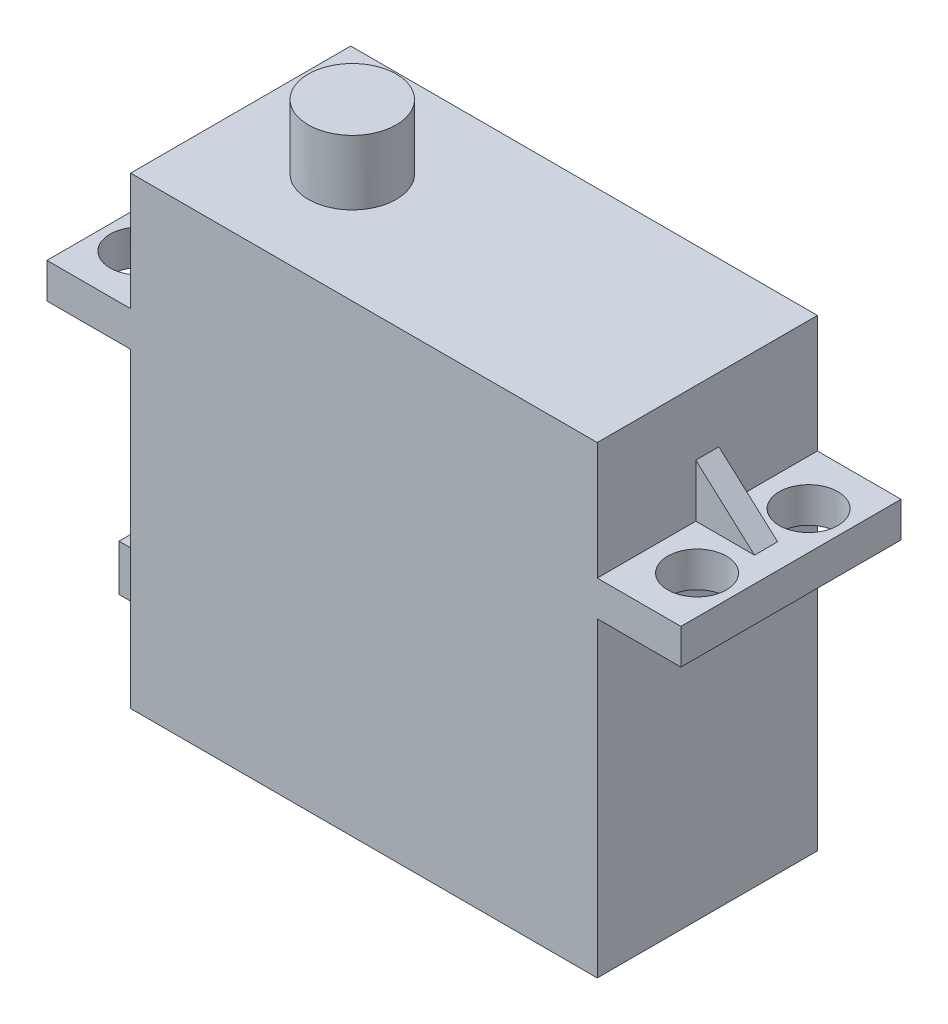
ISO-10303-21;
HEADER;
FILE_DESCRIPTION(('STEP AP214'),'2;1');
FILE_NAME('part.step','',(''),(''),'','','');
FILE_SCHEMA(('AUTOMOTIVE_DESIGN { 1 0 10303 214 1 1 1 1 }'));
ENDSEC;
DATA;
#1=APPLICATION_CONTEXT('core data for automotive mechanical design processes');
#2=APPLICATION_PROTOCOL_DEFINITION('international standard','automotive_design',2000,#1);
#3=PRODUCT_CONTEXT('',#1,'mechanical');
#4=PRODUCT('Part','Part','',(#3));
#5=PRODUCT_RELATED_PRODUCT_CATEGORY('part','',(#4));
#6=PRODUCT_DEFINITION_FORMATION('','',#4);
#7=PRODUCT_DEFINITION_CONTEXT('part definition',#1,'design');
#8=PRODUCT_DEFINITION('design','',#6,#7);
#9=PRODUCT_DEFINITION_SHAPE('','',#8);
#10=(LENGTH_UNIT() NAMED_UNIT(*) SI_UNIT(.MILLI.,.METRE.));
#11=(NAMED_UNIT(*) PLANE_ANGLE_UNIT() SI_UNIT($,.RADIAN.));
#12=(NAMED_UNIT(*) SI_UNIT($,.STERADIAN.) SOLID_ANGLE_UNIT());
#13=UNCERTAINTY_MEASURE_WITH_UNIT(LENGTH_MEASURE(1.E-05),#10,'distance_accuracy_value','');
#14=(GEOMETRIC_REPRESENTATION_CONTEXT(3) GLOBAL_UNCERTAINTY_ASSIGNED_CONTEXT((#13)) GLOBAL_UNIT_ASSIGNED_CONTEXT((#10,
#11,#12)) REPRESENTATION_CONTEXT('',''));
#15=CARTESIAN_POINT('',(0.,0.,0.));
#16=DIRECTION('',(0.,0.,1.));
#17=DIRECTION('',(1.,0.,0.));
#18=AXIS2_PLACEMENT_3D('',#15,#16,#17);
#19=CARTESIAN_POINT('',(40.386,0.,19.05));
#20=DIRECTION('',(-1.,0.,0.));
#21=DIRECTION('',(0.,0.,1.));
#22=AXIS2_PLACEMENT_3D('',#19,#20,#21);
#23=PLANE('',#22);
#24=DIRECTION('',(0.,-1.,0.));
#25=VECTOR('',#24,1.);
#26=CARTESIAN_POINT('',(40.386,34.5510501198393,10.525));
#27=LINE('',#26,#25);
#28=CARTESIAN_POINT('',(40.386,34.5510501198393,10.525));
#29=VERTEX_POINT('',#28);
#30=CARTESIAN_POINT('',(40.386,29.972,10.525));
#31=VERTEX_POINT('',#30);
#32=EDGE_CURVE('E49',#29,#31,#27,.T.);
#33=ORIENTED_EDGE('',*,*,#32,.F.);
#34=DIRECTION('',(0.,0.,-1.));
#35=VECTOR('',#34,1.);
#36=CARTESIAN_POINT('',(40.386,34.5510501198393,10.525));
#37=LINE('',#36,#35);
#38=CARTESIAN_POINT('',(40.386,34.5510501198393,8.52500000000001));
#39=VERTEX_POINT('',#38);
#40=EDGE_CURVE('E54',#29,#39,#37,.T.);
#41=ORIENTED_EDGE('',*,*,#40,.T.);
#42=DIRECTION('',(0.,-1.,0.));
#43=VECTOR('',#42,1.);
#44=CARTESIAN_POINT('',(40.386,34.5510501198393,8.52500000000001));
#45=LINE('',#44,#43);
#46=CARTESIAN_POINT('',(40.386,29.972,8.52500000000001));
#47=VERTEX_POINT('',#46);
#48=EDGE_CURVE('E195',#39,#47,#45,.T.);
#49=ORIENTED_EDGE('',*,*,#48,.T.);
#50=DIRECTION('',(0.,0.,1.));
#51=VECTOR('',#50,1.);
#52=CARTESIAN_POINT('',(40.386,29.972,-7.85451621680165));
#53=LINE('',#52,#51);
#54=CARTESIAN_POINT('',(40.386,29.972,0.));
#55=VERTEX_POINT('',#54);
#56=EDGE_CURVE('E183',#55,#47,#53,.T.);
#57=ORIENTED_EDGE('',*,*,#56,.F.);
#58=DIRECTION('',(0.,1.,0.));
#59=VECTOR('',#58,1.);
#60=CARTESIAN_POINT('',(40.386,0.,0.));
#61=LINE('',#60,#59);
#62=CARTESIAN_POINT('',(40.386,40.132,0.));
#63=VERTEX_POINT('',#62);
#64=EDGE_CURVE('E349',#55,#63,#61,.T.);
#65=ORIENTED_EDGE('',*,*,#64,.T.);
#66=DIRECTION('',(0.,0.,-1.));
#67=VECTOR('',#66,1.);
#68=CARTESIAN_POINT('',(40.386,40.132,19.05));
#69=LINE('',#68,#67);
#70=CARTESIAN_POINT('',(40.386,40.132,19.05));
#71=VERTEX_POINT('',#70);
#72=EDGE_CURVE('E357',#71,#63,#69,.T.);
#73=ORIENTED_EDGE('',*,*,#72,.F.);
#74=DIRECTION('',(0.,1.,0.));
#75=VECTOR('',#74,1.);
#76=CARTESIAN_POINT('',(40.386,0.,19.05));
#77=LINE('',#76,#75);
#78=CARTESIAN_POINT('',(40.386,29.972,19.05));
#79=VERTEX_POINT('',#78);
#80=EDGE_CURVE('E337',#79,#71,#77,.T.);
#81=ORIENTED_EDGE('',*,*,#80,.F.);
#82=EDGE_CURVE('E192',#31,#79,#53,.T.);
#83=ORIENTED_EDGE('',*,*,#82,.F.);
#84=EDGE_LOOP('',(#33,#41,#49,#57,#65,#73,#81,#83));
#85=FACE_BOUND('',#84,.T.);
#86=ADVANCED_FACE('F34',(#85),#23,.F.);
#87=CARTESIAN_POINT('',(40.386,29.972,-7.85451621680165));
#88=DIRECTION('',(0.,1.,0.));
#89=DIRECTION('',(0.,0.,1.));
#90=AXIS2_PLACEMENT_3D('',#87,#88,#89);
#91=PLANE('',#90);
#92=CARTESIAN_POINT('',(44.323,29.972,14.351));
#93=DIRECTION('',(0.,1.,0.));
#94=DIRECTION('',(0.,0.,1.));
#95=AXIS2_PLACEMENT_3D('',#92,#93,#94);
#96=CIRCLE('',#95,2.54);
#97=CARTESIAN_POINT('',(44.323,29.972,16.891));
#98=VERTEX_POINT('',#97);
#99=EDGE_CURVE('E269',#98,#98,#96,.T.);
#100=ORIENTED_EDGE('',*,*,#99,.F.);
#101=EDGE_LOOP('',(#100));
#102=FACE_BOUND('',#101,.T.);
#103=CARTESIAN_POINT('',(44.323,29.972,4.699));
#104=DIRECTION('',(0.,1.,0.));
#105=DIRECTION('',(0.,0.,1.));
#106=AXIS2_PLACEMENT_3D('',#103,#104,#105);
#107=CIRCLE('',#106,2.54);
#108=CARTESIAN_POINT('',(44.323,29.972,7.239));
#109=VERTEX_POINT('',#108);
#110=EDGE_CURVE('E265',#109,#109,#107,.T.);
#111=ORIENTED_EDGE('',*,*,#110,.F.);
#112=EDGE_LOOP('',(#111));
#113=FACE_BOUND('',#112,.T.);
#114=DIRECTION('',(0.,0.,-1.));
#115=VECTOR('',#114,1.);
#116=CARTESIAN_POINT('',(45.466,29.972,10.525));
#117=LINE('',#116,#115);
#118=CARTESIAN_POINT('',(45.466,29.972,10.525));
#119=VERTEX_POINT('',#118);
#120=CARTESIAN_POINT('',(45.466,29.972,8.52500000000001));
#121=VERTEX_POINT('',#120);
#122=EDGE_CURVE('E208',#119,#121,#117,.T.);
#123=ORIENTED_EDGE('',*,*,#122,.F.);
#124=DIRECTION('',(1.,0.,0.));
#125=VECTOR('',#124,1.);
#126=CARTESIAN_POINT('',(40.386,29.972,10.525));
#127=LINE('',#126,#125);
#128=EDGE_CURVE('E197',#31,#119,#127,.T.);
#129=ORIENTED_EDGE('',*,*,#128,.F.);
#130=ORIENTED_EDGE('',*,*,#82,.T.);
#131=DIRECTION('',(-1.,0.,0.));
#132=VECTOR('',#131,1.);
#133=CARTESIAN_POINT('',(40.386,29.972,19.05));
#134=LINE('',#133,#132);
#135=CARTESIAN_POINT('',(47.625,29.972,19.05));
#136=VERTEX_POINT('',#135);
#137=EDGE_CURVE('E282',#136,#79,#134,.T.);
#138=ORIENTED_EDGE('',*,*,#137,.F.);
#139=DIRECTION('',(0.,0.,1.));
#140=VECTOR('',#139,1.);
#141=CARTESIAN_POINT('',(47.625,29.972,-7.85451621680165));
#142=LINE('',#141,#140);
#143=CARTESIAN_POINT('',(47.625,29.972,0.));
#144=VERTEX_POINT('',#143);
#145=EDGE_CURVE('E295',#144,#136,#142,.T.);
#146=ORIENTED_EDGE('',*,*,#145,.F.);
#147=DIRECTION('',(-1.,0.,0.));
#148=VECTOR('',#147,1.);
#149=CARTESIAN_POINT('',(40.386,29.972,0.));
#150=LINE('',#149,#148);
#151=EDGE_CURVE('E189',#144,#55,#150,.T.);
#152=ORIENTED_EDGE('',*,*,#151,.T.);
#153=ORIENTED_EDGE('',*,*,#56,.T.);
#154=DIRECTION('',(1.,0.,0.));
#155=VECTOR('',#154,1.);
#156=CARTESIAN_POINT('',(40.386,29.972,8.52500000000001));
#157=LINE('',#156,#155);
#158=EDGE_CURVE('E186',#47,#121,#157,.T.);
#159=ORIENTED_EDGE('',*,*,#158,.T.);
#160=EDGE_LOOP('',(#123,#129,#130,#138,#146,#152,#153,#159));
#161=FACE_BOUND('',#160,.T.);
#162=ADVANCED_FACE('F184',(#102,#113,#161),#91,.T.);
#163=CARTESIAN_POINT('',(0.,0.,19.05));
#164=DIRECTION('',(1.,0.,0.));
#165=DIRECTION('',(0.,0.,-1.));
#166=AXIS2_PLACEMENT_3D('',#163,#164,#165);
#167=PLANE('',#166);
#168=DIRECTION('',(0.,0.,1.));
#169=VECTOR('',#168,1.);
#170=CARTESIAN_POINT('',(0.,26.924,-7.85451621680165));
#171=LINE('',#170,#169);
#172=CARTESIAN_POINT('',(0.,26.924,0.));
#173=VERTEX_POINT('',#172);
#174=CARTESIAN_POINT('',(0.,26.924,19.05));
#175=VERTEX_POINT('',#174);
#176=EDGE_CURVE('E318',#173,#175,#171,.T.);
#177=ORIENTED_EDGE('',*,*,#176,.F.);
#178=DIRECTION('',(0.,-1.,0.));
#179=VECTOR('',#178,1.);
#180=CARTESIAN_POINT('',(0.,0.,0.));
#181=LINE('',#180,#179);
#182=CARTESIAN_POINT('',(0.,0.,0.));
#183=VERTEX_POINT('',#182);
#184=EDGE_CURVE('E330',#173,#183,#181,.T.);
#185=ORIENTED_EDGE('',*,*,#184,.T.);
#186=DIRECTION('',(0.,0.,-1.));
#187=VECTOR('',#186,1.);
#188=CARTESIAN_POINT('',(0.,0.,19.05));
#189=LINE('',#188,#187);
#190=CARTESIAN_POINT('',(0.,0.,19.05));
#191=VERTEX_POINT('',#190);
#192=EDGE_CURVE('E42',#191,#183,#189,.T.);
#193=ORIENTED_EDGE('',*,*,#192,.F.);
#194=DIRECTION('',(0.,-1.,0.));
#195=VECTOR('',#194,1.);
#196=CARTESIAN_POINT('',(0.,0.,19.05));
#197=LINE('',#196,#195);
#198=EDGE_CURVE('E335',#175,#191,#197,.T.);
#199=ORIENTED_EDGE('',*,*,#198,.F.);
#200=EDGE_LOOP('',(#177,#185,#193,#199));
#201=FACE_BOUND('',#200,.T.);
#202=DIRECTION('',(0.,-1.,0.));
#203=VECTOR('',#202,1.);
#204=CARTESIAN_POINT('',(0.,7.048,5.));
#205=LINE('',#204,#203);
#206=CARTESIAN_POINT('',(0.,7.048,5.));
#207=VERTEX_POINT('',#206);
#208=CARTESIAN_POINT('',(0.,3.048,5.));
#209=VERTEX_POINT('',#208);
#210=EDGE_CURVE('E229',#207,#209,#205,.T.);
#211=ORIENTED_EDGE('',*,*,#210,.F.);
#212=DIRECTION('',(0.,0.,-1.));
#213=VECTOR('',#212,1.);
#214=CARTESIAN_POINT('',(0.,7.048,5.));
#215=LINE('',#214,#213);
#216=CARTESIAN_POINT('',(0.,7.048,14.05));
#217=VERTEX_POINT('',#216);
#218=EDGE_CURVE('E234',#217,#207,#215,.T.);
#219=ORIENTED_EDGE('',*,*,#218,.F.);
#220=DIRECTION('',(0.,1.,0.));
#221=VECTOR('',#220,1.);
#222=CARTESIAN_POINT('',(0.,7.048,14.05));
#223=LINE('',#222,#221);
#224=CARTESIAN_POINT('',(0.,3.048,14.05));
#225=VERTEX_POINT('',#224);
#226=EDGE_CURVE('E246',#225,#217,#223,.T.);
#227=ORIENTED_EDGE('',*,*,#226,.F.);
#228=DIRECTION('',(0.,0.,1.));
#229=VECTOR('',#228,1.);
#230=CARTESIAN_POINT('',(0.,3.048,5.));
#231=LINE('',#230,#229);
#232=EDGE_CURVE('E243',#209,#225,#231,.T.);
#233=ORIENTED_EDGE('',*,*,#232,.F.);
#234=EDGE_LOOP('',(#211,#219,#227,#233));
#235=FACE_BOUND('',#234,.T.);
#236=ADVANCED_FACE('F398',(#201,#235),#167,.F.);
#237=DIRECTION('',(0.,0.,-1.));
#238=VECTOR('',#237,1.);
#239=CARTESIAN_POINT('',(0.,32.512,10.525));
#240=LINE('',#239,#238);
#241=CARTESIAN_POINT('',(0.,32.512,10.525));
#242=VERTEX_POINT('',#241);
#243=CARTESIAN_POINT('',(0.,32.512,8.52500000000001));
#244=VERTEX_POINT('',#243);
#245=EDGE_CURVE('E227',#242,#244,#240,.T.);
#246=ORIENTED_EDGE('',*,*,#245,.F.);
#247=DIRECTION('',(0.,1.,0.));
#248=VECTOR('',#247,1.);
#249=CARTESIAN_POINT('',(0.,32.512,10.525));
#250=LINE('',#249,#248);
#251=CARTESIAN_POINT('',(0.,29.972,10.525));
#252=VERTEX_POINT('',#251);
#253=EDGE_CURVE('E213',#252,#242,#250,.T.);
#254=ORIENTED_EDGE('',*,*,#253,.F.);
#255=DIRECTION('',(0.,0.,1.));
#256=VECTOR('',#255,1.);
#257=CARTESIAN_POINT('',(0.,29.972,-7.85451621680165));
#258=LINE('',#257,#256);
#259=CARTESIAN_POINT('',(0.,29.972,19.05));
#260=VERTEX_POINT('',#259);
#261=EDGE_CURVE('E324',#252,#260,#258,.T.);
#262=ORIENTED_EDGE('',*,*,#261,.T.);
#263=CARTESIAN_POINT('',(0.,40.132,19.05));
#264=VERTEX_POINT('',#263);
#265=EDGE_CURVE('E331',#264,#260,#197,.T.);
#266=ORIENTED_EDGE('',*,*,#265,.F.);
#267=DIRECTION('',(0.,0.,-1.));
#268=VECTOR('',#267,1.);
#269=CARTESIAN_POINT('',(0.,40.132,19.05));
#270=LINE('',#269,#268);
#271=CARTESIAN_POINT('',(0.,40.132,0.));
#272=VERTEX_POINT('',#271);
#273=EDGE_CURVE('E343',#264,#272,#270,.T.);
#274=ORIENTED_EDGE('',*,*,#273,.T.);
#275=CARTESIAN_POINT('',(0.,29.972,0.));
#276=VERTEX_POINT('',#275);
#277=EDGE_CURVE('E344',#272,#276,#181,.T.);
#278=ORIENTED_EDGE('',*,*,#277,.T.);
#279=CARTESIAN_POINT('',(0.,29.972,8.52500000000001));
#280=VERTEX_POINT('',#279);
#281=EDGE_CURVE('E327',#276,#280,#258,.T.);
#282=ORIENTED_EDGE('',*,*,#281,.T.);
#283=DIRECTION('',(0.,1.,0.));
#284=VECTOR('',#283,1.);
#285=CARTESIAN_POINT('',(0.,32.512,8.52500000000001));
#286=LINE('',#285,#284);
#287=EDGE_CURVE('E221',#280,#244,#286,.T.);
#288=ORIENTED_EDGE('',*,*,#287,.T.);
#289=EDGE_LOOP('',(#246,#254,#262,#266,#274,#278,#282,#288));
#290=FACE_BOUND('',#289,.T.);
#291=ADVANCED_FACE('F36',(#290),#167,.F.);
#292=CARTESIAN_POINT('',(0.,0.,19.05));
#293=DIRECTION('',(0.,1.,0.));
#294=DIRECTION('',(0.,0.,1.));
#295=AXIS2_PLACEMENT_3D('',#292,#293,#294);
#296=PLANE('',#295);
#297=DIRECTION('',(1.,0.,0.));
#298=VECTOR('',#297,1.);
#299=CARTESIAN_POINT('',(0.,0.,0.));
#300=LINE('',#299,#298);
#301=CARTESIAN_POINT('',(40.386,0.,0.));
#302=VERTEX_POINT('',#301);
#303=EDGE_CURVE('E347',#183,#302,#300,.T.);
#304=ORIENTED_EDGE('',*,*,#303,.T.);
#305=DIRECTION('',(0.,0.,-1.));
#306=VECTOR('',#305,1.);
#307=CARTESIAN_POINT('',(40.386,0.,19.05));
#308=LINE('',#307,#306);
#309=CARTESIAN_POINT('',(40.386,0.,19.05));
#310=VERTEX_POINT('',#309);
#311=EDGE_CURVE('E360',#310,#302,#308,.T.);
#312=ORIENTED_EDGE('',*,*,#311,.F.);
#313=DIRECTION('',(1.,0.,0.));
#314=VECTOR('',#313,1.);
#315=CARTESIAN_POINT('',(0.,0.,19.05));
#316=LINE('',#315,#314);
#317=EDGE_CURVE('E334',#191,#310,#316,.T.);
#318=ORIENTED_EDGE('',*,*,#317,.F.);
#319=ORIENTED_EDGE('',*,*,#192,.T.);
#320=EDGE_LOOP('',(#304,#312,#318,#319));
#321=FACE_BOUND('',#320,.T.);
#322=ADVANCED_FACE('F450',(#321),#296,.F.);
#323=CARTESIAN_POINT('',(40.386,26.924,0.));
#324=VERTEX_POINT('',#323);
#325=EDGE_CURVE('E350',#302,#324,#61,.T.);
#326=ORIENTED_EDGE('',*,*,#325,.T.);
#327=DIRECTION('',(0.,0.,1.));
#328=VECTOR('',#327,1.);
#329=CARTESIAN_POINT('',(40.386,26.924,-7.85451621680165));
#330=LINE('',#329,#328);
#331=CARTESIAN_POINT('',(40.386,26.924,19.05));
#332=VERTEX_POINT('',#331);
#333=EDGE_CURVE('E191',#324,#332,#330,.T.);
#334=ORIENTED_EDGE('',*,*,#333,.T.);
#335=EDGE_CURVE('E338',#310,#332,#77,.T.);
#336=ORIENTED_EDGE('',*,*,#335,.F.);
#337=ORIENTED_EDGE('',*,*,#311,.T.);
#338=EDGE_LOOP('',(#326,#334,#336,#337));
#339=FACE_BOUND('',#338,.T.);
#340=ADVANCED_FACE('F442',(#339),#23,.F.);
#341=CARTESIAN_POINT('',(0.,40.132,19.05));
#342=DIRECTION('',(0.,-1.,0.));
#343=DIRECTION('',(0.,0.,-1.));
#344=AXIS2_PLACEMENT_3D('',#341,#342,#343);
#345=PLANE('',#344);
#346=CARTESIAN_POINT('',(9.66,40.132,9.525));
#347=DIRECTION('',(0.,-1.,0.));
#348=DIRECTION('',(0.,0.,-1.));
#349=AXIS2_PLACEMENT_3D('',#346,#347,#348);
#350=CIRCLE('',#349,3.81);
#351=CARTESIAN_POINT('',(9.66,40.132,5.715));
#352=VERTEX_POINT('',#351);
#353=EDGE_CURVE('E12',#352,#352,#350,.F.);
#354=ORIENTED_EDGE('',*,*,#353,.F.);
#355=EDGE_LOOP('',(#354));
#356=FACE_BOUND('',#355,.T.);
#357=DIRECTION('',(-1.,0.,0.));
#358=VECTOR('',#357,1.);
#359=CARTESIAN_POINT('',(0.,40.132,0.));
#360=LINE('',#359,#358);
#361=EDGE_CURVE('E353',#63,#272,#360,.T.);
#362=ORIENTED_EDGE('',*,*,#361,.T.);
#363=ORIENTED_EDGE('',*,*,#273,.F.);
#364=DIRECTION('',(-1.,0.,0.));
#365=VECTOR('',#364,1.);
#366=CARTESIAN_POINT('',(0.,40.132,19.05));
#367=LINE('',#366,#365);
#368=EDGE_CURVE('E341',#71,#264,#367,.T.);
#369=ORIENTED_EDGE('',*,*,#368,.F.);
#370=ORIENTED_EDGE('',*,*,#72,.T.);
#371=EDGE_LOOP('',(#362,#363,#369,#370));
#372=FACE_BOUND('',#371,.T.);
#373=ADVANCED_FACE('F417',(#356,#372),#345,.F.);
#374=CARTESIAN_POINT('',(0.,0.,19.05));
#375=DIRECTION('',(0.,0.,-1.));
#376=DIRECTION('',(-1.,0.,0.));
#377=AXIS2_PLACEMENT_3D('',#374,#375,#376);
#378=PLANE('',#377);
#379=ORIENTED_EDGE('',*,*,#265,.T.);
#380=DIRECTION('',(-1.,0.,0.));
#381=VECTOR('',#380,1.);
#382=CARTESIAN_POINT('',(0.,29.972,19.05));
#383=LINE('',#382,#381);
#384=CARTESIAN_POINT('',(-7.239,29.972,19.05));
#385=VERTEX_POINT('',#384);
#386=EDGE_CURVE('E303',#260,#385,#383,.T.);
#387=ORIENTED_EDGE('',*,*,#386,.T.);
#388=DIRECTION('',(0.,-1.,0.));
#389=VECTOR('',#388,1.);
#390=CARTESIAN_POINT('',(-7.239,29.972,19.05));
#391=LINE('',#390,#389);
#392=CARTESIAN_POINT('',(-7.239,26.924,19.05));
#393=VERTEX_POINT('',#392);
#394=EDGE_CURVE('E308',#385,#393,#391,.T.);
#395=ORIENTED_EDGE('',*,*,#394,.T.);
#396=DIRECTION('',(1.,0.,0.));
#397=VECTOR('',#396,1.);
#398=CARTESIAN_POINT('',(0.,26.924,19.05));
#399=LINE('',#398,#397);
#400=EDGE_CURVE('E304',#393,#175,#399,.T.);
#401=ORIENTED_EDGE('',*,*,#400,.T.);
#402=ORIENTED_EDGE('',*,*,#198,.T.);
#403=ORIENTED_EDGE('',*,*,#317,.T.);
#404=ORIENTED_EDGE('',*,*,#335,.T.);
#405=DIRECTION('',(1.,0.,0.));
#406=VECTOR('',#405,1.);
#407=CARTESIAN_POINT('',(40.386,26.924,19.05));
#408=LINE('',#407,#406);
#409=CARTESIAN_POINT('',(47.625,26.924,19.05));
#410=VERTEX_POINT('',#409);
#411=EDGE_CURVE('E281',#332,#410,#408,.T.);
#412=ORIENTED_EDGE('',*,*,#411,.T.);
#413=DIRECTION('',(0.,1.,0.));
#414=VECTOR('',#413,1.);
#415=CARTESIAN_POINT('',(47.625,29.972,19.05));
#416=LINE('',#415,#414);
#417=EDGE_CURVE('E286',#410,#136,#416,.T.);
#418=ORIENTED_EDGE('',*,*,#417,.T.);
#419=ORIENTED_EDGE('',*,*,#137,.T.);
#420=ORIENTED_EDGE('',*,*,#80,.T.);
#421=ORIENTED_EDGE('',*,*,#368,.T.);
#422=EDGE_LOOP('',(#379,#387,#395,#401,#402,#403,#404,#412,#418,#419,#420,#421));
#423=FACE_BOUND('',#422,.T.);
#424=ADVANCED_FACE('F402',(#423),#378,.F.);
#425=CARTESIAN_POINT('',(0.,0.,0.));
#426=DIRECTION('',(0.,0.,-1.));
#427=DIRECTION('',(-1.,0.,0.));
#428=AXIS2_PLACEMENT_3D('',#425,#426,#427);
#429=PLANE('',#428);
#430=ORIENTED_EDGE('',*,*,#277,.F.);
#431=ORIENTED_EDGE('',*,*,#361,.F.);
#432=ORIENTED_EDGE('',*,*,#64,.F.);
#433=ORIENTED_EDGE('',*,*,#151,.F.);
#434=DIRECTION('',(0.,1.,0.));
#435=VECTOR('',#434,1.);
#436=CARTESIAN_POINT('',(47.625,29.972,0.));
#437=LINE('',#436,#435);
#438=CARTESIAN_POINT('',(47.625,26.924,0.));
#439=VERTEX_POINT('',#438);
#440=EDGE_CURVE('E296',#439,#144,#437,.T.);
#441=ORIENTED_EDGE('',*,*,#440,.F.);
#442=DIRECTION('',(1.,0.,0.));
#443=VECTOR('',#442,1.);
#444=CARTESIAN_POINT('',(40.386,26.924,0.));
#445=LINE('',#444,#443);
#446=EDGE_CURVE('E285',#324,#439,#445,.T.);
#447=ORIENTED_EDGE('',*,*,#446,.F.);
#448=ORIENTED_EDGE('',*,*,#325,.F.);
#449=ORIENTED_EDGE('',*,*,#303,.F.);
#450=ORIENTED_EDGE('',*,*,#184,.F.);
#451=DIRECTION('',(1.,0.,0.));
#452=VECTOR('',#451,1.);
#453=CARTESIAN_POINT('',(0.,26.924,0.));
#454=LINE('',#453,#452);
#455=CARTESIAN_POINT('',(-7.239,26.924,0.));
#456=VERTEX_POINT('',#455);
#457=EDGE_CURVE('E316',#456,#173,#454,.T.);
#458=ORIENTED_EDGE('',*,*,#457,.F.);
#459=DIRECTION('',(0.,-1.,0.));
#460=VECTOR('',#459,1.);
#461=CARTESIAN_POINT('',(-7.239,29.972,0.));
#462=LINE('',#461,#460);
#463=CARTESIAN_POINT('',(-7.239,29.972,0.));
#464=VERTEX_POINT('',#463);
#465=EDGE_CURVE('E320',#464,#456,#462,.T.);
#466=ORIENTED_EDGE('',*,*,#465,.F.);
#467=DIRECTION('',(-1.,0.,0.));
#468=VECTOR('',#467,1.);
#469=CARTESIAN_POINT('',(0.,29.972,0.));
#470=LINE('',#469,#468);
#471=EDGE_CURVE('E307',#276,#464,#470,.T.);
#472=ORIENTED_EDGE('',*,*,#471,.F.);
#473=EDGE_LOOP('',(#430,#431,#432,#433,#441,#447,#448,#449,#450,#458,#466,#472));
#474=FACE_BOUND('',#473,.T.);
#475=ADVANCED_FACE('F391',(#474),#429,.T.);
#476=CARTESIAN_POINT('',(0.,29.972,-7.85451621680165));
#477=DIRECTION('',(0.,1.,0.));
#478=DIRECTION('',(0.,0.,1.));
#479=AXIS2_PLACEMENT_3D('',#476,#477,#478);
#480=PLANE('',#479);
#481=DIRECTION('',(1.,0.,0.));
#482=VECTOR('',#481,1.);
#483=CARTESIAN_POINT('',(0.,29.972,10.525));
#484=LINE('',#483,#482);
#485=CARTESIAN_POINT('',(-6.35,29.972,10.525));
#486=VERTEX_POINT('',#485);
#487=EDGE_CURVE('E211',#486,#252,#484,.T.);
#488=ORIENTED_EDGE('',*,*,#487,.F.);
#489=DIRECTION('',(0.,0.,-1.));
#490=VECTOR('',#489,1.);
#491=CARTESIAN_POINT('',(-6.35,29.972,10.525));
#492=LINE('',#491,#490);
#493=CARTESIAN_POINT('',(-6.35,29.972,8.52500000000001));
#494=VERTEX_POINT('',#493);
#495=EDGE_CURVE('E218',#486,#494,#492,.T.);
#496=ORIENTED_EDGE('',*,*,#495,.T.);
#497=DIRECTION('',(1.,0.,0.));
#498=VECTOR('',#497,1.);
#499=CARTESIAN_POINT('',(0.,29.972,8.52500000000001));
#500=LINE('',#499,#498);
#501=EDGE_CURVE('E210',#494,#280,#500,.T.);
#502=ORIENTED_EDGE('',*,*,#501,.T.);
#503=ORIENTED_EDGE('',*,*,#281,.F.);
#504=ORIENTED_EDGE('',*,*,#471,.T.);
#505=DIRECTION('',(0.,0.,1.));
#506=VECTOR('',#505,1.);
#507=CARTESIAN_POINT('',(-7.239,29.972,-7.85451621680165));
#508=LINE('',#507,#506);
#509=EDGE_CURVE('E315',#464,#385,#508,.T.);
#510=ORIENTED_EDGE('',*,*,#509,.T.);
#511=ORIENTED_EDGE('',*,*,#386,.F.);
#512=ORIENTED_EDGE('',*,*,#261,.F.);
#513=EDGE_LOOP('',(#488,#496,#502,#503,#504,#510,#511,#512));
#514=FACE_BOUND('',#513,.T.);
#515=CARTESIAN_POINT('',(-3.937,29.972,4.699));
#516=DIRECTION('',(0.,1.,0.));
#517=DIRECTION('',(0.,0.,1.));
#518=AXIS2_PLACEMENT_3D('',#515,#516,#517);
#519=CIRCLE('',#518,2.54);
#520=CARTESIAN_POINT('',(-3.937,29.972,7.239));
#521=VERTEX_POINT('',#520);
#522=EDGE_CURVE('E278',#521,#521,#519,.T.);
#523=ORIENTED_EDGE('',*,*,#522,.F.);
#524=EDGE_LOOP('',(#523));
#525=FACE_BOUND('',#524,.T.);
#526=CARTESIAN_POINT('',(-3.93700000000001,29.972,14.351));
#527=DIRECTION('',(0.,1.,0.));
#528=DIRECTION('',(0.,0.,1.));
#529=AXIS2_PLACEMENT_3D('',#526,#527,#528);
#530=CIRCLE('',#529,2.54);
#531=CARTESIAN_POINT('',(-3.93700000000001,29.972,16.891));
#532=VERTEX_POINT('',#531);
#533=EDGE_CURVE('E274',#532,#532,#530,.T.);
#534=ORIENTED_EDGE('',*,*,#533,.F.);
#535=EDGE_LOOP('',(#534));
#536=FACE_BOUND('',#535,.T.);
#537=ADVANCED_FACE('F409',(#514,#525,#536),#480,.T.);
#538=CARTESIAN_POINT('',(-7.239,29.972,-7.85451621680165));
#539=DIRECTION('',(-1.,0.,0.));
#540=DIRECTION('',(0.,0.,1.));
#541=AXIS2_PLACEMENT_3D('',#538,#539,#540);
#542=PLANE('',#541);
#543=ORIENTED_EDGE('',*,*,#509,.F.);
#544=ORIENTED_EDGE('',*,*,#465,.T.);
#545=DIRECTION('',(0.,0.,1.));
#546=VECTOR('',#545,1.);
#547=CARTESIAN_POINT('',(-7.239,26.924,-7.85451621680165));
#548=LINE('',#547,#546);
#549=EDGE_CURVE('E319',#456,#393,#548,.T.);
#550=ORIENTED_EDGE('',*,*,#549,.T.);
#551=ORIENTED_EDGE('',*,*,#394,.F.);
#552=EDGE_LOOP('',(#543,#544,#550,#551));
#553=FACE_BOUND('',#552,.T.);
#554=ADVANCED_FACE('F379',(#553),#542,.T.);
#555=CARTESIAN_POINT('',(0.,26.924,-7.85451621680165));
#556=DIRECTION('',(0.,-1.,0.));
#557=DIRECTION('',(0.,0.,-1.));
#558=AXIS2_PLACEMENT_3D('',#555,#556,#557);
#559=PLANE('',#558);
#560=CARTESIAN_POINT('',(-3.937,26.924,4.699));
#561=DIRECTION('',(0.,-1.,0.));
#562=DIRECTION('',(0.,0.,-1.));
#563=AXIS2_PLACEMENT_3D('',#560,#561,#562);
#564=CIRCLE('',#563,2.54);
#565=CARTESIAN_POINT('',(-3.937,26.924,2.159));
#566=VERTEX_POINT('',#565);
#567=EDGE_CURVE('E277',#566,#566,#564,.T.);
#568=ORIENTED_EDGE('',*,*,#567,.F.);
#569=EDGE_LOOP('',(#568));
#570=FACE_BOUND('',#569,.T.);
#571=CARTESIAN_POINT('',(-3.93700000000001,26.924,14.351));
#572=DIRECTION('',(0.,-1.,0.));
#573=DIRECTION('',(0.,0.,-1.));
#574=AXIS2_PLACEMENT_3D('',#571,#572,#573);
#575=CIRCLE('',#574,2.54);
#576=CARTESIAN_POINT('',(-3.93700000000001,26.924,11.811));
#577=VERTEX_POINT('',#576);
#578=EDGE_CURVE('E273',#577,#577,#575,.T.);
#579=ORIENTED_EDGE('',*,*,#578,.F.);
#580=EDGE_LOOP('',(#579));
#581=FACE_BOUND('',#580,.T.);
#582=ORIENTED_EDGE('',*,*,#549,.F.);
#583=ORIENTED_EDGE('',*,*,#457,.T.);
#584=ORIENTED_EDGE('',*,*,#176,.T.);
#585=ORIENTED_EDGE('',*,*,#400,.F.);
#586=EDGE_LOOP('',(#582,#583,#584,#585));
#587=FACE_BOUND('',#586,.T.);
#588=ADVANCED_FACE('F375',(#570,#581,#587),#559,.T.);
#589=CARTESIAN_POINT('',(40.386,26.924,-7.85451621680165));
#590=DIRECTION('',(0.,-1.,0.));
#591=DIRECTION('',(0.,0.,-1.));
#592=AXIS2_PLACEMENT_3D('',#589,#590,#591);
#593=PLANE('',#592);
#594=CARTESIAN_POINT('',(44.323,26.924,14.351));
#595=DIRECTION('',(0.,-1.,0.));
#596=DIRECTION('',(0.,0.,-1.));
#597=AXIS2_PLACEMENT_3D('',#594,#595,#596);
#598=CIRCLE('',#597,2.54);
#599=CARTESIAN_POINT('',(44.323,26.924,11.811));
#600=VERTEX_POINT('',#599);
#601=EDGE_CURVE('E270',#600,#600,#598,.T.);
#602=ORIENTED_EDGE('',*,*,#601,.F.);
#603=EDGE_LOOP('',(#602));
#604=FACE_BOUND('',#603,.T.);
#605=CARTESIAN_POINT('',(44.323,26.924,4.699));
#606=DIRECTION('',(0.,-1.,0.));
#607=DIRECTION('',(0.,0.,-1.));
#608=AXIS2_PLACEMENT_3D('',#605,#606,#607);
#609=CIRCLE('',#608,2.54);
#610=CARTESIAN_POINT('',(44.323,26.924,2.159));
#611=VERTEX_POINT('',#610);
#612=EDGE_CURVE('E266',#611,#611,#609,.T.);
#613=ORIENTED_EDGE('',*,*,#612,.F.);
#614=EDGE_LOOP('',(#613));
#615=FACE_BOUND('',#614,.T.);
#616=ORIENTED_EDGE('',*,*,#333,.F.);
#617=ORIENTED_EDGE('',*,*,#446,.T.);
#618=DIRECTION('',(0.,0.,1.));
#619=VECTOR('',#618,1.);
#620=CARTESIAN_POINT('',(47.625,26.924,-7.85451621680165));
#621=LINE('',#620,#619);
#622=EDGE_CURVE('E293',#439,#410,#621,.T.);
#623=ORIENTED_EDGE('',*,*,#622,.T.);
#624=ORIENTED_EDGE('',*,*,#411,.F.);
#625=EDGE_LOOP('',(#616,#617,#623,#624));
#626=FACE_BOUND('',#625,.T.);
#627=ADVANCED_FACE('F378',(#604,#615,#626),#593,.T.);
#628=CARTESIAN_POINT('',(47.625,29.972,-7.85451621680165));
#629=DIRECTION('',(1.,0.,0.));
#630=DIRECTION('',(0.,0.,-1.));
#631=AXIS2_PLACEMENT_3D('',#628,#629,#630);
#632=PLANE('',#631);
#633=ORIENTED_EDGE('',*,*,#622,.F.);
#634=ORIENTED_EDGE('',*,*,#440,.T.);
#635=ORIENTED_EDGE('',*,*,#145,.T.);
#636=ORIENTED_EDGE('',*,*,#417,.F.);
#637=EDGE_LOOP('',(#633,#634,#635,#636));
#638=FACE_BOUND('',#637,.T.);
#639=ADVANCED_FACE('F464',(#638),#632,.T.);
#640=CARTESIAN_POINT('',(44.323,0.,4.699));
#641=DIRECTION('',(0.,1.,0.));
#642=DIRECTION('',(0.,0.,1.));
#643=AXIS2_PLACEMENT_3D('',#640,#641,#642);
#644=CYLINDRICAL_SURFACE('',#643,2.54);
#645=ORIENTED_EDGE('',*,*,#612,.T.);
#646=EDGE_LOOP('',(#645));
#647=FACE_BOUND('',#646,.T.);
#648=ORIENTED_EDGE('',*,*,#110,.T.);
#649=EDGE_LOOP('',(#648));
#650=FACE_BOUND('',#649,.T.);
#651=ADVANCED_FACE('F466',(#647,#650),#644,.F.);
#652=CARTESIAN_POINT('',(44.323,0.,14.351));
#653=DIRECTION('',(0.,1.,0.));
#654=DIRECTION('',(0.,0.,1.));
#655=AXIS2_PLACEMENT_3D('',#652,#653,#654);
#656=CYLINDRICAL_SURFACE('',#655,2.54);
#657=ORIENTED_EDGE('',*,*,#601,.T.);
#658=EDGE_LOOP('',(#657));
#659=FACE_BOUND('',#658,.T.);
#660=ORIENTED_EDGE('',*,*,#99,.T.);
#661=EDGE_LOOP('',(#660));
#662=FACE_BOUND('',#661,.T.);
#663=ADVANCED_FACE('F472',(#659,#662),#656,.F.);
#664=CARTESIAN_POINT('',(-3.93700000000001,0.,14.351));
#665=DIRECTION('',(0.,1.,0.));
#666=DIRECTION('',(0.,0.,1.));
#667=AXIS2_PLACEMENT_3D('',#664,#665,#666);
#668=CYLINDRICAL_SURFACE('',#667,2.54);
#669=ORIENTED_EDGE('',*,*,#533,.T.);
#670=EDGE_LOOP('',(#669));
#671=FACE_BOUND('',#670,.T.);
#672=ORIENTED_EDGE('',*,*,#578,.T.);
#673=EDGE_LOOP('',(#672));
#674=FACE_BOUND('',#673,.T.);
#675=ADVANCED_FACE('F524',(#671,#674),#668,.F.);
#676=CARTESIAN_POINT('',(-3.937,0.,4.699));
#677=DIRECTION('',(0.,1.,0.));
#678=DIRECTION('',(0.,0.,1.));
#679=AXIS2_PLACEMENT_3D('',#676,#677,#678);
#680=CYLINDRICAL_SURFACE('',#679,2.54);
#681=ORIENTED_EDGE('',*,*,#522,.T.);
#682=EDGE_LOOP('',(#681));
#683=FACE_BOUND('',#682,.T.);
#684=ORIENTED_EDGE('',*,*,#567,.T.);
#685=EDGE_LOOP('',(#684));
#686=FACE_BOUND('',#685,.T.);
#687=ADVANCED_FACE('F373',(#683,#686),#680,.F.);
#688=CARTESIAN_POINT('',(9.66,102.216307345283,9.525));
#689=DIRECTION('',(0.,-1.,0.));
#690=DIRECTION('',(0.,0.,-1.));
#691=AXIS2_PLACEMENT_3D('',#688,#689,#690);
#692=CYLINDRICAL_SURFACE('',#691,3.81);
#693=ORIENTED_EDGE('',*,*,#353,.T.);
#694=EDGE_LOOP('',(#693));
#695=FACE_BOUND('',#694,.T.);
#696=CARTESIAN_POINT('',(9.66,45.72,9.525));
#697=DIRECTION('',(0.,1.,0.));
#698=DIRECTION('',(0.,0.,1.));
#699=AXIS2_PLACEMENT_3D('',#696,#697,#698);
#700=CIRCLE('',#699,3.81);
#701=CARTESIAN_POINT('',(9.66,45.72,13.335));
#702=VERTEX_POINT('',#701);
#703=EDGE_CURVE('E262',#702,#702,#700,.T.);
#704=ORIENTED_EDGE('',*,*,#703,.F.);
#705=EDGE_LOOP('',(#704));
#706=FACE_BOUND('',#705,.T.);
#707=ADVANCED_FACE('F542',(#695,#706),#692,.T.);
#708=CARTESIAN_POINT('',(0.,45.72,19.05));
#709=DIRECTION('',(0.,1.,0.));
#710=DIRECTION('',(0.,0.,1.));
#711=AXIS2_PLACEMENT_3D('',#708,#709,#710);
#712=PLANE('',#711);
#713=ORIENTED_EDGE('',*,*,#703,.T.);
#714=EDGE_LOOP('',(#713));
#715=FACE_BOUND('',#714,.T.);
#716=ADVANCED_FACE('F560',(#715),#712,.T.);
#717=CARTESIAN_POINT('',(-6.,7.048,5.));
#718=DIRECTION('',(0.,0.,1.));
#719=DIRECTION('',(1.,0.,0.));
#720=AXIS2_PLACEMENT_3D('',#717,#718,#719);
#721=PLANE('',#720);
#722=ORIENTED_EDGE('',*,*,#210,.T.);
#723=DIRECTION('',(1.,0.,0.));
#724=VECTOR('',#723,1.);
#725=CARTESIAN_POINT('',(-6.,3.048,5.));
#726=LINE('',#725,#724);
#727=CARTESIAN_POINT('',(-6.,3.048,5.));
#728=VERTEX_POINT('',#727);
#729=EDGE_CURVE('E259',#728,#209,#726,.T.);
#730=ORIENTED_EDGE('',*,*,#729,.F.);
#731=DIRECTION('',(0.,-1.,0.));
#732=VECTOR('',#731,1.);
#733=CARTESIAN_POINT('',(-6.,7.048,5.));
#734=LINE('',#733,#732);
#735=CARTESIAN_POINT('',(-6.,7.048,5.));
#736=VERTEX_POINT('',#735);
#737=EDGE_CURVE('E230',#736,#728,#734,.T.);
#738=ORIENTED_EDGE('',*,*,#737,.F.);
#739=DIRECTION('',(1.,0.,0.));
#740=VECTOR('',#739,1.);
#741=CARTESIAN_POINT('',(-6.,7.048,5.));
#742=LINE('',#741,#740);
#743=EDGE_CURVE('E240',#736,#207,#742,.T.);
#744=ORIENTED_EDGE('',*,*,#743,.T.);
#745=EDGE_LOOP('',(#722,#730,#738,#744));
#746=FACE_BOUND('',#745,.T.);
#747=ADVANCED_FACE('F570',(#746),#721,.F.);
#748=CARTESIAN_POINT('',(-6.,3.048,5.));
#749=DIRECTION('',(0.,1.,0.));
#750=DIRECTION('',(0.,0.,1.));
#751=AXIS2_PLACEMENT_3D('',#748,#749,#750);
#752=PLANE('',#751);
#753=ORIENTED_EDGE('',*,*,#232,.T.);
#754=DIRECTION('',(1.,0.,0.));
#755=VECTOR('',#754,1.);
#756=CARTESIAN_POINT('',(-6.,3.048,14.05));
#757=LINE('',#756,#755);
#758=CARTESIAN_POINT('',(-6.,3.048,14.05));
#759=VERTEX_POINT('',#758);
#760=EDGE_CURVE('E256',#759,#225,#757,.T.);
#761=ORIENTED_EDGE('',*,*,#760,.F.);
#762=DIRECTION('',(0.,0.,1.));
#763=VECTOR('',#762,1.);
#764=CARTESIAN_POINT('',(-6.,3.048,5.));
#765=LINE('',#764,#763);
#766=EDGE_CURVE('E233',#728,#759,#765,.T.);
#767=ORIENTED_EDGE('',*,*,#766,.F.);
#768=ORIENTED_EDGE('',*,*,#729,.T.);
#769=EDGE_LOOP('',(#753,#761,#767,#768));
#770=FACE_BOUND('',#769,.T.);
#771=ADVANCED_FACE('F588',(#770),#752,.F.);
#772=CARTESIAN_POINT('',(-6.,7.048,14.05));
#773=DIRECTION('',(0.,0.,-1.));
#774=DIRECTION('',(0.,1.,0.));
#775=AXIS2_PLACEMENT_3D('',#772,#773,#774);
#776=PLANE('',#775);
#777=ORIENTED_EDGE('',*,*,#226,.T.);
#778=DIRECTION('',(1.,0.,0.));
#779=VECTOR('',#778,1.);
#780=CARTESIAN_POINT('',(-6.,7.048,14.05));
#781=LINE('',#780,#779);
#782=CARTESIAN_POINT('',(-6.,7.048,14.05));
#783=VERTEX_POINT('',#782);
#784=EDGE_CURVE('E253',#783,#217,#781,.T.);
#785=ORIENTED_EDGE('',*,*,#784,.F.);
#786=DIRECTION('',(0.,1.,0.));
#787=VECTOR('',#786,1.);
#788=CARTESIAN_POINT('',(-6.,7.048,14.05));
#789=LINE('',#788,#787);
#790=EDGE_CURVE('E236',#759,#783,#789,.T.);
#791=ORIENTED_EDGE('',*,*,#790,.F.);
#792=ORIENTED_EDGE('',*,*,#760,.T.);
#793=EDGE_LOOP('',(#777,#785,#791,#792));
#794=FACE_BOUND('',#793,.T.);
#795=ADVANCED_FACE('F598',(#794),#776,.F.);
#796=CARTESIAN_POINT('',(-6.,7.048,5.));
#797=DIRECTION('',(0.,-1.,0.));
#798=DIRECTION('',(0.,0.,-1.));
#799=AXIS2_PLACEMENT_3D('',#796,#797,#798);
#800=PLANE('',#799);
#801=ORIENTED_EDGE('',*,*,#218,.T.);
#802=ORIENTED_EDGE('',*,*,#743,.F.);
#803=DIRECTION('',(0.,0.,-1.));
#804=VECTOR('',#803,1.);
#805=CARTESIAN_POINT('',(-6.,7.048,5.));
#806=LINE('',#805,#804);
#807=EDGE_CURVE('E238',#783,#736,#806,.T.);
#808=ORIENTED_EDGE('',*,*,#807,.F.);
#809=ORIENTED_EDGE('',*,*,#784,.T.);
#810=EDGE_LOOP('',(#801,#802,#808,#809));
#811=FACE_BOUND('',#810,.T.);
#812=ADVANCED_FACE('F608',(#811),#800,.F.);
#813=CARTESIAN_POINT('',(-6.,0.,0.));
#814=DIRECTION('',(-1.,0.,0.));
#815=DIRECTION('',(0.,0.,1.));
#816=AXIS2_PLACEMENT_3D('',#813,#814,#815);
#817=PLANE('',#816);
#818=ORIENTED_EDGE('',*,*,#737,.T.);
#819=ORIENTED_EDGE('',*,*,#766,.T.);
#820=ORIENTED_EDGE('',*,*,#790,.T.);
#821=ORIENTED_EDGE('',*,*,#807,.T.);
#822=EDGE_LOOP('',(#818,#819,#820,#821));
#823=FACE_BOUND('',#822,.T.);
#824=ADVANCED_FACE('F618',(#823),#817,.T.);
#825=CARTESIAN_POINT('',(-6.35,29.972,10.525));
#826=DIRECTION('',(0.371390676354104,-0.928476690885259,0.));
#827=DIRECTION('',(0.928476690885259,0.371390676354104,0.));
#828=AXIS2_PLACEMENT_3D('',#825,#826,#827);
#829=PLANE('',#828);
#830=DIRECTION('',(-0.928476690885259,-0.371390676354104,0.));
#831=VECTOR('',#830,1.);
#832=CARTESIAN_POINT('',(-6.35,29.972,8.52500000000001));
#833=LINE('',#832,#831);
#834=EDGE_CURVE('E214',#244,#494,#833,.T.);
#835=ORIENTED_EDGE('',*,*,#834,.T.);
#836=ORIENTED_EDGE('',*,*,#495,.F.);
#837=DIRECTION('',(-0.928476690885259,-0.371390676354104,0.));
#838=VECTOR('',#837,1.);
#839=CARTESIAN_POINT('',(-6.35,29.972,10.525));
#840=LINE('',#839,#838);
#841=EDGE_CURVE('E216',#242,#486,#840,.T.);
#842=ORIENTED_EDGE('',*,*,#841,.F.);
#843=ORIENTED_EDGE('',*,*,#245,.T.);
#844=EDGE_LOOP('',(#835,#836,#842,#843));
#845=FACE_BOUND('',#844,.T.);
#846=ADVANCED_FACE('F627',(#845),#829,.F.);
#847=CARTESIAN_POINT('',(0.,0.,10.525));
#848=DIRECTION('',(0.,0.,1.));
#849=DIRECTION('',(1.,0.,0.));
#850=AXIS2_PLACEMENT_3D('',#847,#848,#849);
#851=PLANE('',#850);
#852=ORIENTED_EDGE('',*,*,#487,.T.);
#853=ORIENTED_EDGE('',*,*,#253,.T.);
#854=ORIENTED_EDGE('',*,*,#841,.T.);
#855=EDGE_LOOP('',(#852,#853,#854));
#856=FACE_BOUND('',#855,.T.);
#857=ADVANCED_FACE('F685',(#856),#851,.T.);
#858=CARTESIAN_POINT('',(0.,0.,8.52500000000001));
#859=DIRECTION('',(0.,0.,1.));
#860=DIRECTION('',(1.,0.,0.));
#861=AXIS2_PLACEMENT_3D('',#858,#859,#860);
#862=PLANE('',#861);
#863=ORIENTED_EDGE('',*,*,#501,.F.);
#864=ORIENTED_EDGE('',*,*,#834,.F.);
#865=ORIENTED_EDGE('',*,*,#287,.F.);
#866=EDGE_LOOP('',(#863,#864,#865));
#867=FACE_BOUND('',#866,.T.);
#868=ADVANCED_FACE('F437',(#867),#862,.F.);
#869=CARTESIAN_POINT('',(45.466,29.972,10.525));
#870=DIRECTION('',(-0.669534063411986,-0.742781352708207,0.));
#871=DIRECTION('',(0.742781352708207,-0.669534063411986,0.));
#872=AXIS2_PLACEMENT_3D('',#869,#870,#871);
#873=PLANE('',#872);
#874=DIRECTION('',(-0.742781352708207,0.669534063411986,0.));
#875=VECTOR('',#874,1.);
#876=CARTESIAN_POINT('',(45.466,29.972,8.52500000000001));
#877=LINE('',#876,#875);
#878=EDGE_CURVE('E198',#121,#39,#877,.T.);
#879=ORIENTED_EDGE('',*,*,#878,.T.);
#880=ORIENTED_EDGE('',*,*,#40,.F.);
#881=DIRECTION('',(-0.742781352708207,0.669534063411986,0.));
#882=VECTOR('',#881,1.);
#883=CARTESIAN_POINT('',(45.466,29.972,10.525));
#884=LINE('',#883,#882);
#885=EDGE_CURVE('E426',#119,#29,#884,.T.);
#886=ORIENTED_EDGE('',*,*,#885,.F.);
#887=ORIENTED_EDGE('',*,*,#122,.T.);
#888=EDGE_LOOP('',(#879,#880,#886,#887));
#889=FACE_BOUND('',#888,.T.);
#890=ADVANCED_FACE('F430',(#889),#873,.F.);
#891=CARTESIAN_POINT('',(0.,0.,10.525));
#892=DIRECTION('',(0.,0.,-1.));
#893=DIRECTION('',(-1.,0.,0.));
#894=AXIS2_PLACEMENT_3D('',#891,#892,#893);
#895=PLANE('',#894);
#896=ORIENTED_EDGE('',*,*,#128,.T.);
#897=ORIENTED_EDGE('',*,*,#885,.T.);
#898=ORIENTED_EDGE('',*,*,#32,.T.);
#899=EDGE_LOOP('',(#896,#897,#898));
#900=FACE_BOUND('',#899,.T.);
#901=ADVANCED_FACE('F428',(#900),#895,.F.);
#902=CARTESIAN_POINT('',(0.,0.,8.52500000000001));
#903=DIRECTION('',(0.,0.,-1.));
#904=DIRECTION('',(-1.,0.,0.));
#905=AXIS2_PLACEMENT_3D('',#902,#903,#904);
#906=PLANE('',#905);
#907=ORIENTED_EDGE('',*,*,#158,.F.);
#908=ORIENTED_EDGE('',*,*,#48,.F.);
#909=ORIENTED_EDGE('',*,*,#878,.F.);
#910=EDGE_LOOP('',(#907,#908,#909));
#911=FACE_BOUND('',#910,.T.);
#912=ADVANCED_FACE('F200',(#911),#906,.T.);
#913=CLOSED_SHELL('',(#86,#162,#236,#291,#322,#340,#373,#424,#475,#537,#554,#588,#627,#639,#651,
#663,#675,#687,#707,#716,#747,#771,#795,#812,#824,#846,#857,#868,#890,#901,#912));
#914=MANIFOLD_SOLID_BREP('B2',#913);
#915=ADVANCED_BREP_SHAPE_REPRESENTATION('',(#18,#914),#14);
#916=SHAPE_DEFINITION_REPRESENTATION(#9,#915);
ENDSEC;
END-ISO-10303-21;
